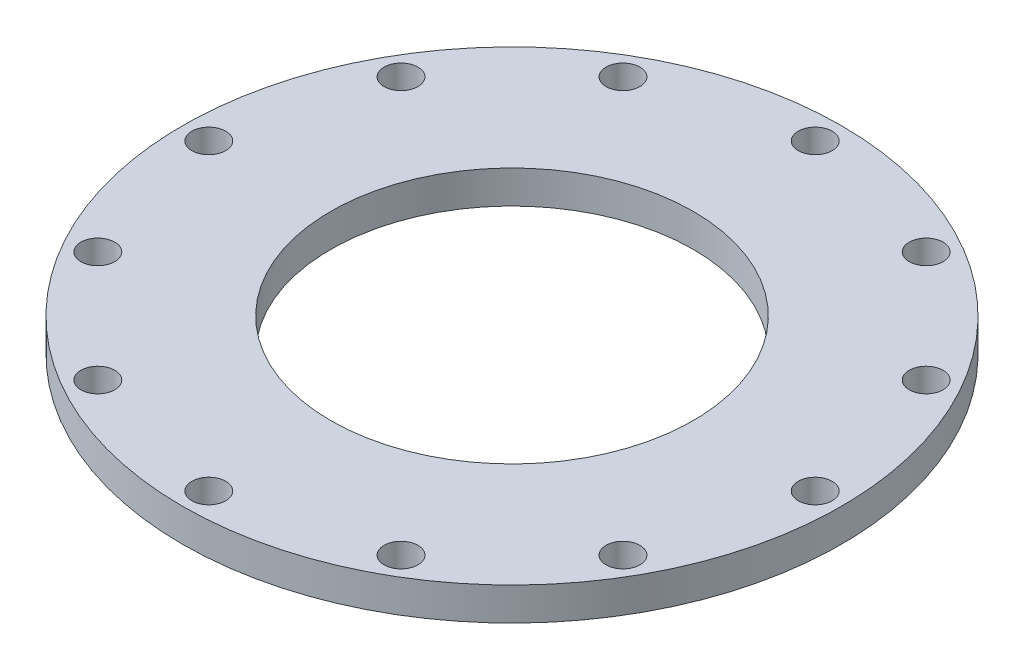
ISO-10303-21;
HEADER;
FILE_DESCRIPTION(('STEP AP214'),'2;1');
FILE_NAME('part.step','',(''),(''),'','','');
FILE_SCHEMA(('AUTOMOTIVE_DESIGN { 1 0 10303 214 1 1 1 1 }'));
ENDSEC;
DATA;
#1=APPLICATION_CONTEXT('core data for automotive mechanical design processes');
#2=APPLICATION_PROTOCOL_DEFINITION('international standard','automotive_design',2000,#1);
#3=PRODUCT_CONTEXT('',#1,'mechanical');
#4=PRODUCT('Part','Part','',(#3));
#5=PRODUCT_RELATED_PRODUCT_CATEGORY('part','',(#4));
#6=PRODUCT_DEFINITION_FORMATION('','',#4);
#7=PRODUCT_DEFINITION_CONTEXT('part definition',#1,'design');
#8=PRODUCT_DEFINITION('design','',#6,#7);
#9=PRODUCT_DEFINITION_SHAPE('','',#8);
#10=(LENGTH_UNIT() NAMED_UNIT(*) SI_UNIT(.MILLI.,.METRE.));
#11=(NAMED_UNIT(*) PLANE_ANGLE_UNIT() SI_UNIT($,.RADIAN.));
#12=(NAMED_UNIT(*) SI_UNIT($,.STERADIAN.) SOLID_ANGLE_UNIT());
#13=UNCERTAINTY_MEASURE_WITH_UNIT(LENGTH_MEASURE(1.E-05),#10,'distance_accuracy_value','');
#14=(GEOMETRIC_REPRESENTATION_CONTEXT(3) GLOBAL_UNCERTAINTY_ASSIGNED_CONTEXT((#13)) GLOBAL_UNIT_ASSIGNED_CONTEXT((#10,
#11,#12)) REPRESENTATION_CONTEXT('',''));
#15=CARTESIAN_POINT('',(0.,0.,0.));
#16=DIRECTION('',(0.,0.,1.));
#17=DIRECTION('',(1.,0.,0.));
#18=AXIS2_PLACEMENT_3D('',#15,#16,#17);
#19=CARTESIAN_POINT('',(0.,6.35,0.));
#20=DIRECTION('',(0.,1.,0.));
#21=DIRECTION('',(0.,0.,1.));
#22=AXIS2_PLACEMENT_3D('',#19,#20,#21);
#23=PLANE('',#22);
#24=CARTESIAN_POINT('',(-50.5932040890857,6.35,-29.2099999999978));
#25=DIRECTION('',(0.,1.,0.));
#26=DIRECTION('',(0.,0.,1.));
#27=AXIS2_PLACEMENT_3D('',#24,#25,#26);
#28=CIRCLE('',#27,3.2639000000025);
#29=CARTESIAN_POINT('',(-50.5932040890857,6.35,-25.9460999999953));
#30=VERTEX_POINT('',#29);
#31=EDGE_CURVE('E136',#30,#30,#28,.T.);
#32=ORIENTED_EDGE('',*,*,#31,.F.);
#33=EDGE_LOOP('',(#32));
#34=FACE_BOUND('',#33,.T.);
#35=CARTESIAN_POINT('',(-50.5932040890832,6.35,29.2100000000022));
#36=DIRECTION('',(0.,1.,0.));
#37=DIRECTION('',(0.,0.,1.));
#38=AXIS2_PLACEMENT_3D('',#35,#36,#37);
#39=CIRCLE('',#38,3.26390000000471);
#40=CARTESIAN_POINT('',(-50.5932040890832,6.35,32.4739000000069));
#41=VERTEX_POINT('',#40);
#42=EDGE_CURVE('E120',#41,#41,#39,.T.);
#43=ORIENTED_EDGE('',*,*,#42,.F.);
#44=EDGE_LOOP('',(#43));
#45=FACE_BOUND('',#44,.T.);
#46=CARTESIAN_POINT('',(4.95972563497075E-12,6.35,58.42));
#47=DIRECTION('',(0.,1.,0.));
#48=DIRECTION('',(0.,0.,1.));
#49=AXIS2_PLACEMENT_3D('',#46,#47,#48);
#50=CIRCLE('',#49,3.26390000000513);
#51=CARTESIAN_POINT('',(4.95972563497075E-12,6.35,61.6839000000051));
#52=VERTEX_POINT('',#51);
#53=EDGE_CURVE('E104',#52,#52,#50,.T.);
#54=ORIENTED_EDGE('',*,*,#53,.F.);
#55=EDGE_LOOP('',(#54));
#56=FACE_BOUND('',#55,.T.);
#57=CARTESIAN_POINT('',(50.5932040890906,6.35,29.2099999999978));
#58=DIRECTION('',(0.,1.,0.));
#59=DIRECTION('',(0.,0.,1.));
#60=AXIS2_PLACEMENT_3D('',#57,#58,#59);
#61=CIRCLE('',#60,3.26390000000319);
#62=CARTESIAN_POINT('',(50.5932040890906,6.35,32.473900000001));
#63=VERTEX_POINT('',#62);
#64=EDGE_CURVE('E88',#63,#63,#61,.T.);
#65=ORIENTED_EDGE('',*,*,#64,.F.);
#66=EDGE_LOOP('',(#65));
#67=FACE_BOUND('',#66,.T.);
#68=CARTESIAN_POINT('',(50.5932040890881,6.35,-29.2100000000021));
#69=DIRECTION('',(0.,1.,0.));
#70=DIRECTION('',(0.,0.,1.));
#71=AXIS2_PLACEMENT_3D('',#68,#69,#70);
#72=CIRCLE('',#71,3.2639000000007);
#73=CARTESIAN_POINT('',(50.5932040890881,6.35,-25.9461000000015));
#74=VERTEX_POINT('',#73);
#75=EDGE_CURVE('E72',#74,#74,#72,.T.);
#76=ORIENTED_EDGE('',*,*,#75,.F.);
#77=EDGE_LOOP('',(#76));
#78=FACE_BOUND('',#77,.T.);
#79=CARTESIAN_POINT('',(0.,6.35,-58.42));
#80=DIRECTION('',(0.,1.,0.));
#81=DIRECTION('',(0.,0.,1.));
#82=AXIS2_PLACEMENT_3D('',#79,#80,#81);
#83=CIRCLE('',#82,3.2639);
#84=CARTESIAN_POINT('',(0.,6.35,-55.1561));
#85=VERTEX_POINT('',#84);
#86=EDGE_CURVE('E56',#85,#85,#83,.T.);
#87=ORIENTED_EDGE('',*,*,#86,.F.);
#88=EDGE_LOOP('',(#87));
#89=FACE_BOUND('',#88,.T.);
#90=CARTESIAN_POINT('',(0.,6.35,0.));
#91=DIRECTION('',(0.,1.,0.));
#92=DIRECTION('',(0.,0.,1.));
#93=AXIS2_PLACEMENT_3D('',#90,#91,#92);
#94=CIRCLE('',#93,63.5);
#95=CARTESIAN_POINT('',(0.,6.35,63.5));
#96=VERTEX_POINT('',#95);
#97=EDGE_CURVE('E10',#96,#96,#94,.T.);
#98=ORIENTED_EDGE('',*,*,#97,.T.);
#99=EDGE_LOOP('',(#98));
#100=FACE_BOUND('',#99,.T.);
#101=CARTESIAN_POINT('',(0.,6.35,0.));
#102=DIRECTION('',(0.,1.,0.));
#103=DIRECTION('',(0.,0.,1.));
#104=AXIS2_PLACEMENT_3D('',#101,#102,#103);
#105=CIRCLE('',#104,34.925);
#106=CARTESIAN_POINT('',(0.,6.35,34.925));
#107=VERTEX_POINT('',#106);
#108=EDGE_CURVE('E50',#107,#107,#105,.T.);
#109=ORIENTED_EDGE('',*,*,#108,.F.);
#110=EDGE_LOOP('',(#109));
#111=FACE_BOUND('',#110,.T.);
#112=CARTESIAN_POINT('',(29.2100000000001,6.35,-50.5932040890869));
#113=DIRECTION('',(0.,1.,0.));
#114=DIRECTION('',(0.,0.,1.));
#115=AXIS2_PLACEMENT_3D('',#112,#113,#114);
#116=CIRCLE('',#115,3.2639);
#117=CARTESIAN_POINT('',(29.2100000000001,6.35,-47.3293040890869));
#118=VERTEX_POINT('',#117);
#119=EDGE_CURVE('E64',#118,#118,#116,.T.);
#120=ORIENTED_EDGE('',*,*,#119,.F.);
#121=EDGE_LOOP('',(#120));
#122=FACE_BOUND('',#121,.T.);
#123=CARTESIAN_POINT('',(58.4200000000025,6.35,-2.47986281748537E-12));
#124=DIRECTION('',(0.,1.,0.));
#125=DIRECTION('',(0.,0.,1.));
#126=AXIS2_PLACEMENT_3D('',#123,#124,#125);
#127=CIRCLE('',#126,3.26390000000184);
#128=CARTESIAN_POINT('',(58.4200000000025,6.35,3.26389999999936));
#129=VERTEX_POINT('',#128);
#130=EDGE_CURVE('E80',#129,#129,#127,.T.);
#131=ORIENTED_EDGE('',*,*,#130,.F.);
#132=EDGE_LOOP('',(#131));
#133=FACE_BOUND('',#132,.T.);
#134=CARTESIAN_POINT('',(29.2100000000046,6.35,50.5932040890857));
#135=DIRECTION('',(0.,1.,0.));
#136=DIRECTION('',(0.,0.,1.));
#137=AXIS2_PLACEMENT_3D('',#134,#135,#136);
#138=CIRCLE('',#137,3.26390000000441);
#139=CARTESIAN_POINT('',(29.2100000000046,6.35,53.8571040890901));
#140=VERTEX_POINT('',#139);
#141=EDGE_CURVE('E96',#140,#140,#138,.T.);
#142=ORIENTED_EDGE('',*,*,#141,.F.);
#143=EDGE_LOOP('',(#142));
#144=FACE_BOUND('',#143,.T.);
#145=CARTESIAN_POINT('',(-29.2099999999954,6.35,50.5932040890881));
#146=DIRECTION('',(0.,1.,0.));
#147=DIRECTION('',(0.,0.,1.));
#148=AXIS2_PLACEMENT_3D('',#145,#146,#147);
#149=CIRCLE('',#148,3.26390000000525);
#150=CARTESIAN_POINT('',(-29.2099999999954,6.35,53.8571040890934));
#151=VERTEX_POINT('',#150);
#152=EDGE_CURVE('E112',#151,#151,#149,.T.);
#153=ORIENTED_EDGE('',*,*,#152,.F.);
#154=EDGE_LOOP('',(#153));
#155=FACE_BOUND('',#154,.T.);
#156=CARTESIAN_POINT('',(-58.4199999999975,6.35,2.48701720408599E-12));
#157=DIRECTION('',(0.,1.,0.));
#158=DIRECTION('',(0.,0.,1.));
#159=AXIS2_PLACEMENT_3D('',#156,#157,#158);
#160=CIRCLE('',#159,3.26390000000369);
#161=CARTESIAN_POINT('',(-58.4199999999975,6.35,3.26390000000617));
#162=VERTEX_POINT('',#161);
#163=EDGE_CURVE('E128',#162,#162,#160,.T.);
#164=ORIENTED_EDGE('',*,*,#163,.F.);
#165=EDGE_LOOP('',(#164));
#166=FACE_BOUND('',#165,.T.);
#167=CARTESIAN_POINT('',(-29.2099999999997,6.35,-50.5932040890856));
#168=DIRECTION('',(0.,1.,0.));
#169=DIRECTION('',(0.,0.,1.));
#170=AXIS2_PLACEMENT_3D('',#167,#168,#169);
#171=CIRCLE('',#170,3.26390000000142);
#172=CARTESIAN_POINT('',(-29.2099999999997,6.35,-47.3293040890842));
#173=VERTEX_POINT('',#172);
#174=EDGE_CURVE('E144',#173,#173,#171,.T.);
#175=ORIENTED_EDGE('',*,*,#174,.F.);
#176=EDGE_LOOP('',(#175));
#177=FACE_BOUND('',#176,.T.);
#178=ADVANCED_FACE('F37',(#34,#45,#56,#67,#78,#89,#100,#111,#122,#133,#144,#155,#166,#177),#23,.T.);
#179=CARTESIAN_POINT('',(0.,0.,0.));
#180=DIRECTION('',(0.,1.,0.));
#181=DIRECTION('',(0.,0.,1.));
#182=AXIS2_PLACEMENT_3D('',#179,#180,#181);
#183=PLANE('',#182);
#184=CARTESIAN_POINT('',(0.,0.,0.));
#185=DIRECTION('',(0.,1.,0.));
#186=DIRECTION('',(0.,0.,1.));
#187=AXIS2_PLACEMENT_3D('',#184,#185,#186);
#188=CIRCLE('',#187,63.5);
#189=CARTESIAN_POINT('',(0.,0.,63.5));
#190=VERTEX_POINT('',#189);
#191=EDGE_CURVE('E41',#190,#190,#188,.T.);
#192=ORIENTED_EDGE('',*,*,#191,.F.);
#193=EDGE_LOOP('',(#192));
#194=FACE_BOUND('',#193,.T.);
#195=CARTESIAN_POINT('',(0.,0.,0.));
#196=DIRECTION('',(0.,1.,0.));
#197=DIRECTION('',(0.,0.,1.));
#198=AXIS2_PLACEMENT_3D('',#195,#196,#197);
#199=CIRCLE('',#198,34.925);
#200=CARTESIAN_POINT('',(0.,0.,34.925));
#201=VERTEX_POINT('',#200);
#202=EDGE_CURVE('E52',#201,#201,#199,.T.);
#203=ORIENTED_EDGE('',*,*,#202,.T.);
#204=EDGE_LOOP('',(#203));
#205=FACE_BOUND('',#204,.T.);
#206=CARTESIAN_POINT('',(0.,0.,-58.42));
#207=DIRECTION('',(0.,1.,0.));
#208=DIRECTION('',(0.,0.,1.));
#209=AXIS2_PLACEMENT_3D('',#206,#207,#208);
#210=CIRCLE('',#209,3.2639);
#211=CARTESIAN_POINT('',(0.,0.,-55.1561));
#212=VERTEX_POINT('',#211);
#213=EDGE_CURVE('E60',#212,#212,#210,.T.);
#214=ORIENTED_EDGE('',*,*,#213,.T.);
#215=EDGE_LOOP('',(#214));
#216=FACE_BOUND('',#215,.T.);
#217=CARTESIAN_POINT('',(29.2100000000001,0.,-50.5932040890869));
#218=DIRECTION('',(0.,1.,0.));
#219=DIRECTION('',(0.,0.,1.));
#220=AXIS2_PLACEMENT_3D('',#217,#218,#219);
#221=CIRCLE('',#220,3.2639);
#222=CARTESIAN_POINT('',(29.2100000000001,0.,-47.3293040890869));
#223=VERTEX_POINT('',#222);
#224=EDGE_CURVE('E68',#223,#223,#221,.T.);
#225=ORIENTED_EDGE('',*,*,#224,.T.);
#226=EDGE_LOOP('',(#225));
#227=FACE_BOUND('',#226,.T.);
#228=CARTESIAN_POINT('',(50.5932040890881,0.,-29.2100000000021));
#229=DIRECTION('',(0.,1.,0.));
#230=DIRECTION('',(0.,0.,1.));
#231=AXIS2_PLACEMENT_3D('',#228,#229,#230);
#232=CIRCLE('',#231,3.2639000000007);
#233=CARTESIAN_POINT('',(50.5932040890881,0.,-25.9461000000015));
#234=VERTEX_POINT('',#233);
#235=EDGE_CURVE('E76',#234,#234,#232,.T.);
#236=ORIENTED_EDGE('',*,*,#235,.T.);
#237=EDGE_LOOP('',(#236));
#238=FACE_BOUND('',#237,.T.);
#239=CARTESIAN_POINT('',(58.4200000000025,0.,-2.47986281748537E-12));
#240=DIRECTION('',(0.,1.,0.));
#241=DIRECTION('',(0.,0.,1.));
#242=AXIS2_PLACEMENT_3D('',#239,#240,#241);
#243=CIRCLE('',#242,3.26390000000184);
#244=CARTESIAN_POINT('',(58.4200000000025,0.,3.26389999999936));
#245=VERTEX_POINT('',#244);
#246=EDGE_CURVE('E84',#245,#245,#243,.T.);
#247=ORIENTED_EDGE('',*,*,#246,.T.);
#248=EDGE_LOOP('',(#247));
#249=FACE_BOUND('',#248,.T.);
#250=CARTESIAN_POINT('',(50.5932040890906,0.,29.2099999999978));
#251=DIRECTION('',(0.,1.,0.));
#252=DIRECTION('',(0.,0.,1.));
#253=AXIS2_PLACEMENT_3D('',#250,#251,#252);
#254=CIRCLE('',#253,3.26390000000319);
#255=CARTESIAN_POINT('',(50.5932040890906,0.,32.473900000001));
#256=VERTEX_POINT('',#255);
#257=EDGE_CURVE('E92',#256,#256,#254,.T.);
#258=ORIENTED_EDGE('',*,*,#257,.T.);
#259=EDGE_LOOP('',(#258));
#260=FACE_BOUND('',#259,.T.);
#261=CARTESIAN_POINT('',(29.2100000000046,0.,50.5932040890857));
#262=DIRECTION('',(0.,1.,0.));
#263=DIRECTION('',(0.,0.,1.));
#264=AXIS2_PLACEMENT_3D('',#261,#262,#263);
#265=CIRCLE('',#264,3.26390000000441);
#266=CARTESIAN_POINT('',(29.2100000000046,0.,53.8571040890901));
#267=VERTEX_POINT('',#266);
#268=EDGE_CURVE('E100',#267,#267,#265,.T.);
#269=ORIENTED_EDGE('',*,*,#268,.T.);
#270=EDGE_LOOP('',(#269));
#271=FACE_BOUND('',#270,.T.);
#272=CARTESIAN_POINT('',(4.95972563497075E-12,0.,58.42));
#273=DIRECTION('',(0.,1.,0.));
#274=DIRECTION('',(0.,0.,1.));
#275=AXIS2_PLACEMENT_3D('',#272,#273,#274);
#276=CIRCLE('',#275,3.26390000000513);
#277=CARTESIAN_POINT('',(4.95972563497075E-12,0.,61.6839000000051));
#278=VERTEX_POINT('',#277);
#279=EDGE_CURVE('E108',#278,#278,#276,.T.);
#280=ORIENTED_EDGE('',*,*,#279,.T.);
#281=EDGE_LOOP('',(#280));
#282=FACE_BOUND('',#281,.T.);
#283=CARTESIAN_POINT('',(-29.2099999999954,0.,50.5932040890881));
#284=DIRECTION('',(0.,1.,0.));
#285=DIRECTION('',(0.,0.,1.));
#286=AXIS2_PLACEMENT_3D('',#283,#284,#285);
#287=CIRCLE('',#286,3.26390000000525);
#288=CARTESIAN_POINT('',(-29.2099999999954,0.,53.8571040890934));
#289=VERTEX_POINT('',#288);
#290=EDGE_CURVE('E116',#289,#289,#287,.T.);
#291=ORIENTED_EDGE('',*,*,#290,.T.);
#292=EDGE_LOOP('',(#291));
#293=FACE_BOUND('',#292,.T.);
#294=CARTESIAN_POINT('',(-50.5932040890832,0.,29.2100000000022));
#295=DIRECTION('',(0.,1.,0.));
#296=DIRECTION('',(0.,0.,1.));
#297=AXIS2_PLACEMENT_3D('',#294,#295,#296);
#298=CIRCLE('',#297,3.26390000000471);
#299=CARTESIAN_POINT('',(-50.5932040890832,0.,32.4739000000069));
#300=VERTEX_POINT('',#299);
#301=EDGE_CURVE('E124',#300,#300,#298,.T.);
#302=ORIENTED_EDGE('',*,*,#301,.T.);
#303=EDGE_LOOP('',(#302));
#304=FACE_BOUND('',#303,.T.);
#305=CARTESIAN_POINT('',(-58.4199999999975,0.,2.48701720408599E-12));
#306=DIRECTION('',(0.,1.,0.));
#307=DIRECTION('',(0.,0.,1.));
#308=AXIS2_PLACEMENT_3D('',#305,#306,#307);
#309=CIRCLE('',#308,3.26390000000369);
#310=CARTESIAN_POINT('',(-58.4199999999975,0.,3.26390000000617));
#311=VERTEX_POINT('',#310);
#312=EDGE_CURVE('E132',#311,#311,#309,.T.);
#313=ORIENTED_EDGE('',*,*,#312,.T.);
#314=EDGE_LOOP('',(#313));
#315=FACE_BOUND('',#314,.T.);
#316=CARTESIAN_POINT('',(-50.5932040890857,0.,-29.2099999999978));
#317=DIRECTION('',(0.,1.,0.));
#318=DIRECTION('',(0.,0.,1.));
#319=AXIS2_PLACEMENT_3D('',#316,#317,#318);
#320=CIRCLE('',#319,3.2639000000025);
#321=CARTESIAN_POINT('',(-50.5932040890857,0.,-25.9460999999953));
#322=VERTEX_POINT('',#321);
#323=EDGE_CURVE('E140',#322,#322,#320,.T.);
#324=ORIENTED_EDGE('',*,*,#323,.T.);
#325=EDGE_LOOP('',(#324));
#326=FACE_BOUND('',#325,.T.);
#327=CARTESIAN_POINT('',(-29.2099999999997,0.,-50.5932040890856));
#328=DIRECTION('',(0.,1.,0.));
#329=DIRECTION('',(0.,0.,1.));
#330=AXIS2_PLACEMENT_3D('',#327,#328,#329);
#331=CIRCLE('',#330,3.26390000000142);
#332=CARTESIAN_POINT('',(-29.2099999999997,0.,-47.3293040890842));
#333=VERTEX_POINT('',#332);
#334=EDGE_CURVE('E148',#333,#333,#331,.T.);
#335=ORIENTED_EDGE('',*,*,#334,.T.);
#336=EDGE_LOOP('',(#335));
#337=FACE_BOUND('',#336,.T.);
#338=ADVANCED_FACE('F160',(#194,#205,#216,#227,#238,#249,#260,#271,#282,#293,#304,#315,#326,
#337),#183,.F.);
#339=CARTESIAN_POINT('',(0.,6.35,0.));
#340=DIRECTION('',(0.,-1.,0.));
#341=DIRECTION('',(0.,0.,-1.));
#342=AXIS2_PLACEMENT_3D('',#339,#340,#341);
#343=CYLINDRICAL_SURFACE('',#342,63.5);
#344=ORIENTED_EDGE('',*,*,#97,.F.);
#345=EDGE_LOOP('',(#344));
#346=FACE_BOUND('',#345,.T.);
#347=ORIENTED_EDGE('',*,*,#191,.T.);
#348=EDGE_LOOP('',(#347));
#349=FACE_BOUND('',#348,.T.);
#350=ADVANCED_FACE('F39',(#346,#349),#343,.T.);
#351=CARTESIAN_POINT('',(0.,6.35,0.));
#352=DIRECTION('',(0.,-1.,0.));
#353=DIRECTION('',(0.,0.,-1.));
#354=AXIS2_PLACEMENT_3D('',#351,#352,#353);
#355=CYLINDRICAL_SURFACE('',#354,34.925);
#356=ORIENTED_EDGE('',*,*,#108,.T.);
#357=EDGE_LOOP('',(#356));
#358=FACE_BOUND('',#357,.T.);
#359=ORIENTED_EDGE('',*,*,#202,.F.);
#360=EDGE_LOOP('',(#359));
#361=FACE_BOUND('',#360,.T.);
#362=ADVANCED_FACE('F170',(#358,#361),#355,.F.);
#363=CARTESIAN_POINT('',(0.,6.35,-58.42));
#364=DIRECTION('',(0.,-1.,0.));
#365=DIRECTION('',(0.,0.,-1.));
#366=AXIS2_PLACEMENT_3D('',#363,#364,#365);
#367=CYLINDRICAL_SURFACE('',#366,3.2639);
#368=ORIENTED_EDGE('',*,*,#86,.T.);
#369=EDGE_LOOP('',(#368));
#370=FACE_BOUND('',#369,.T.);
#371=ORIENTED_EDGE('',*,*,#213,.F.);
#372=EDGE_LOOP('',(#371));
#373=FACE_BOUND('',#372,.T.);
#374=ADVANCED_FACE('F173',(#370,#373),#367,.F.);
#375=CARTESIAN_POINT('',(29.2100000000001,6.35,-50.5932040890869));
#376=DIRECTION('',(0.,-1.,0.));
#377=DIRECTION('',(0.,0.,-1.));
#378=AXIS2_PLACEMENT_3D('',#375,#376,#377);
#379=CYLINDRICAL_SURFACE('',#378,3.2639);
#380=ORIENTED_EDGE('',*,*,#119,.T.);
#381=EDGE_LOOP('',(#380));
#382=FACE_BOUND('',#381,.T.);
#383=ORIENTED_EDGE('',*,*,#224,.F.);
#384=EDGE_LOOP('',(#383));
#385=FACE_BOUND('',#384,.T.);
#386=ADVANCED_FACE('F177',(#382,#385),#379,.F.);
#387=CARTESIAN_POINT('',(50.5932040890881,6.35,-29.2100000000021));
#388=DIRECTION('',(0.,-1.,0.));
#389=DIRECTION('',(0.,0.,-1.));
#390=AXIS2_PLACEMENT_3D('',#387,#388,#389);
#391=CYLINDRICAL_SURFACE('',#390,3.2639000000007);
#392=ORIENTED_EDGE('',*,*,#75,.T.);
#393=EDGE_LOOP('',(#392));
#394=FACE_BOUND('',#393,.T.);
#395=ORIENTED_EDGE('',*,*,#235,.F.);
#396=EDGE_LOOP('',(#395));
#397=FACE_BOUND('',#396,.T.);
#398=ADVANCED_FACE('F181',(#394,#397),#391,.F.);
#399=CARTESIAN_POINT('',(58.4200000000025,6.35,-2.47986281748537E-12));
#400=DIRECTION('',(0.,-1.,0.));
#401=DIRECTION('',(0.,0.,-1.));
#402=AXIS2_PLACEMENT_3D('',#399,#400,#401);
#403=CYLINDRICAL_SURFACE('',#402,3.26390000000184);
#404=ORIENTED_EDGE('',*,*,#130,.T.);
#405=EDGE_LOOP('',(#404));
#406=FACE_BOUND('',#405,.T.);
#407=ORIENTED_EDGE('',*,*,#246,.F.);
#408=EDGE_LOOP('',(#407));
#409=FACE_BOUND('',#408,.T.);
#410=ADVANCED_FACE('F185',(#406,#409),#403,.F.);
#411=CARTESIAN_POINT('',(50.5932040890906,6.35,29.2099999999978));
#412=DIRECTION('',(0.,-1.,0.));
#413=DIRECTION('',(0.,0.,-1.));
#414=AXIS2_PLACEMENT_3D('',#411,#412,#413);
#415=CYLINDRICAL_SURFACE('',#414,3.26390000000319);
#416=ORIENTED_EDGE('',*,*,#64,.T.);
#417=EDGE_LOOP('',(#416));
#418=FACE_BOUND('',#417,.T.);
#419=ORIENTED_EDGE('',*,*,#257,.F.);
#420=EDGE_LOOP('',(#419));
#421=FACE_BOUND('',#420,.T.);
#422=ADVANCED_FACE('F189',(#418,#421),#415,.F.);
#423=CARTESIAN_POINT('',(29.2100000000046,6.35,50.5932040890857));
#424=DIRECTION('',(0.,-1.,0.));
#425=DIRECTION('',(0.,0.,-1.));
#426=AXIS2_PLACEMENT_3D('',#423,#424,#425);
#427=CYLINDRICAL_SURFACE('',#426,3.26390000000441);
#428=ORIENTED_EDGE('',*,*,#141,.T.);
#429=EDGE_LOOP('',(#428));
#430=FACE_BOUND('',#429,.T.);
#431=ORIENTED_EDGE('',*,*,#268,.F.);
#432=EDGE_LOOP('',(#431));
#433=FACE_BOUND('',#432,.T.);
#434=ADVANCED_FACE('F193',(#430,#433),#427,.F.);
#435=CARTESIAN_POINT('',(4.95972563497075E-12,6.35,58.42));
#436=DIRECTION('',(0.,-1.,0.));
#437=DIRECTION('',(0.,0.,-1.));
#438=AXIS2_PLACEMENT_3D('',#435,#436,#437);
#439=CYLINDRICAL_SURFACE('',#438,3.26390000000513);
#440=ORIENTED_EDGE('',*,*,#53,.T.);
#441=EDGE_LOOP('',(#440));
#442=FACE_BOUND('',#441,.T.);
#443=ORIENTED_EDGE('',*,*,#279,.F.);
#444=EDGE_LOOP('',(#443));
#445=FACE_BOUND('',#444,.T.);
#446=ADVANCED_FACE('F197',(#442,#445),#439,.F.);
#447=CARTESIAN_POINT('',(-29.2099999999954,6.35,50.5932040890881));
#448=DIRECTION('',(0.,-1.,0.));
#449=DIRECTION('',(0.,0.,-1.));
#450=AXIS2_PLACEMENT_3D('',#447,#448,#449);
#451=CYLINDRICAL_SURFACE('',#450,3.26390000000525);
#452=ORIENTED_EDGE('',*,*,#152,.T.);
#453=EDGE_LOOP('',(#452));
#454=FACE_BOUND('',#453,.T.);
#455=ORIENTED_EDGE('',*,*,#290,.F.);
#456=EDGE_LOOP('',(#455));
#457=FACE_BOUND('',#456,.T.);
#458=ADVANCED_FACE('F201',(#454,#457),#451,.F.);
#459=CARTESIAN_POINT('',(-50.5932040890832,6.35,29.2100000000022));
#460=DIRECTION('',(0.,-1.,0.));
#461=DIRECTION('',(0.,0.,-1.));
#462=AXIS2_PLACEMENT_3D('',#459,#460,#461);
#463=CYLINDRICAL_SURFACE('',#462,3.26390000000471);
#464=ORIENTED_EDGE('',*,*,#42,.T.);
#465=EDGE_LOOP('',(#464));
#466=FACE_BOUND('',#465,.T.);
#467=ORIENTED_EDGE('',*,*,#301,.F.);
#468=EDGE_LOOP('',(#467));
#469=FACE_BOUND('',#468,.T.);
#470=ADVANCED_FACE('F205',(#466,#469),#463,.F.);
#471=CARTESIAN_POINT('',(-58.4199999999975,6.35,2.48701720408599E-12));
#472=DIRECTION('',(0.,-1.,0.));
#473=DIRECTION('',(0.,0.,-1.));
#474=AXIS2_PLACEMENT_3D('',#471,#472,#473);
#475=CYLINDRICAL_SURFACE('',#474,3.26390000000369);
#476=ORIENTED_EDGE('',*,*,#163,.T.);
#477=EDGE_LOOP('',(#476));
#478=FACE_BOUND('',#477,.T.);
#479=ORIENTED_EDGE('',*,*,#312,.F.);
#480=EDGE_LOOP('',(#479));
#481=FACE_BOUND('',#480,.T.);
#482=ADVANCED_FACE('F209',(#478,#481),#475,.F.);
#483=CARTESIAN_POINT('',(-50.5932040890857,6.35,-29.2099999999978));
#484=DIRECTION('',(0.,-1.,0.));
#485=DIRECTION('',(0.,0.,-1.));
#486=AXIS2_PLACEMENT_3D('',#483,#484,#485);
#487=CYLINDRICAL_SURFACE('',#486,3.2639000000025);
#488=ORIENTED_EDGE('',*,*,#31,.T.);
#489=EDGE_LOOP('',(#488));
#490=FACE_BOUND('',#489,.T.);
#491=ORIENTED_EDGE('',*,*,#323,.F.);
#492=EDGE_LOOP('',(#491));
#493=FACE_BOUND('',#492,.T.);
#494=ADVANCED_FACE('F213',(#490,#493),#487,.F.);
#495=CARTESIAN_POINT('',(-29.2099999999997,6.35,-50.5932040890856));
#496=DIRECTION('',(0.,-1.,0.));
#497=DIRECTION('',(0.,0.,-1.));
#498=AXIS2_PLACEMENT_3D('',#495,#496,#497);
#499=CYLINDRICAL_SURFACE('',#498,3.26390000000142);
#500=ORIENTED_EDGE('',*,*,#174,.T.);
#501=EDGE_LOOP('',(#500));
#502=FACE_BOUND('',#501,.T.);
#503=ORIENTED_EDGE('',*,*,#334,.F.);
#504=EDGE_LOOP('',(#503));
#505=FACE_BOUND('',#504,.T.);
#506=ADVANCED_FACE('F156',(#502,#505),#499,.F.);
#507=CLOSED_SHELL('',(#178,#338,#350,#362,#374,#386,#398,#410,#422,#434,#446,#458,#470,#482,
#494,#506));
#508=MANIFOLD_SOLID_BREP('B2',#507);
#509=ADVANCED_BREP_SHAPE_REPRESENTATION('',(#18,#508),#14);
#510=SHAPE_DEFINITION_REPRESENTATION(#9,#509);
ENDSEC;
END-ISO-10303-21;
